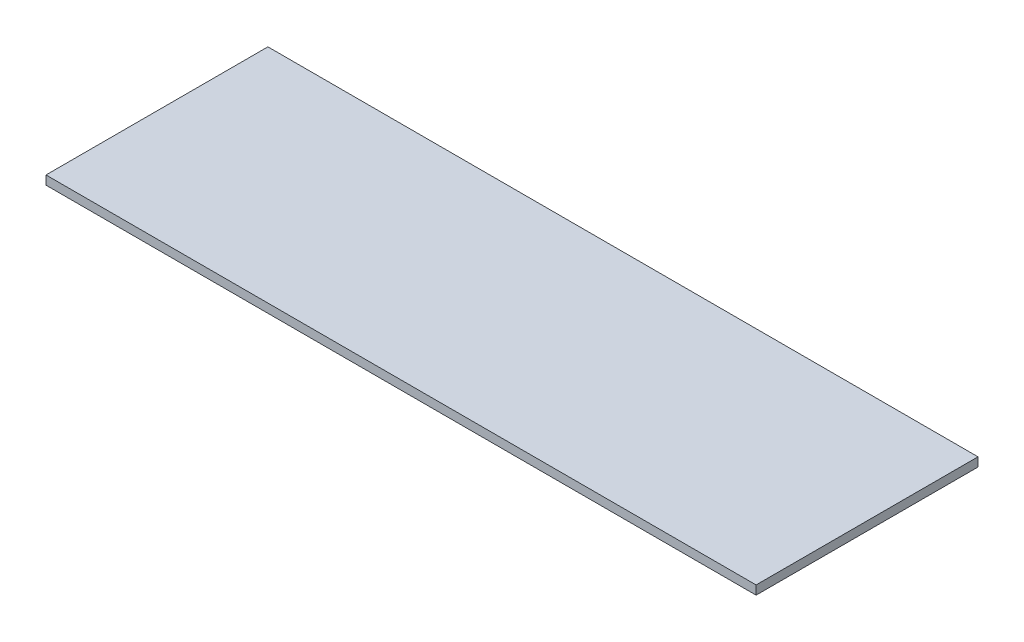
ISO-10303-21;
HEADER;
FILE_DESCRIPTION(('STEP AP214'),'2;1');
FILE_NAME('part.step','',(''),(''),'','','');
FILE_SCHEMA(('AUTOMOTIVE_DESIGN { 1 0 10303 214 1 1 1 1 }'));
ENDSEC;
DATA;
#1=APPLICATION_CONTEXT('core data for automotive mechanical design processes');
#2=APPLICATION_PROTOCOL_DEFINITION('international standard','automotive_design',2000,#1);
#3=PRODUCT_CONTEXT('',#1,'mechanical');
#4=PRODUCT('Part','Part','',(#3));
#5=PRODUCT_RELATED_PRODUCT_CATEGORY('part','',(#4));
#6=PRODUCT_DEFINITION_FORMATION('','',#4);
#7=PRODUCT_DEFINITION_CONTEXT('part definition',#1,'design');
#8=PRODUCT_DEFINITION('design','',#6,#7);
#9=PRODUCT_DEFINITION_SHAPE('','',#8);
#10=(LENGTH_UNIT() NAMED_UNIT(*) SI_UNIT(.MILLI.,.METRE.));
#11=(NAMED_UNIT(*) PLANE_ANGLE_UNIT() SI_UNIT($,.RADIAN.));
#12=(NAMED_UNIT(*) SI_UNIT($,.STERADIAN.) SOLID_ANGLE_UNIT());
#13=UNCERTAINTY_MEASURE_WITH_UNIT(LENGTH_MEASURE(1.E-05),#10,'distance_accuracy_value','');
#14=(GEOMETRIC_REPRESENTATION_CONTEXT(3) GLOBAL_UNCERTAINTY_ASSIGNED_CONTEXT((#13)) GLOBAL_UNIT_ASSIGNED_CONTEXT((#10,
#11,#12)) REPRESENTATION_CONTEXT('',''));
#15=CARTESIAN_POINT('',(0.,0.,0.));
#16=DIRECTION('',(0.,0.,1.));
#17=DIRECTION('',(1.,0.,0.));
#18=AXIS2_PLACEMENT_3D('',#15,#16,#17);
#19=CARTESIAN_POINT('',(0.,2.,0.));
#20=DIRECTION('',(1.,0.,0.));
#21=DIRECTION('',(0.,0.,-1.));
#22=AXIS2_PLACEMENT_3D('',#19,#20,#21);
#23=PLANE('',#22);
#24=DIRECTION('',(0.,0.,1.));
#25=VECTOR('',#24,1.);
#26=CARTESIAN_POINT('',(0.,0.,0.));
#27=LINE('',#26,#25);
#28=CARTESIAN_POINT('',(0.,0.,-50.));
#29=VERTEX_POINT('',#28);
#30=CARTESIAN_POINT('',(0.,0.,0.));
#31=VERTEX_POINT('',#30);
#32=EDGE_CURVE('E96',#29,#31,#27,.T.);
#33=ORIENTED_EDGE('',*,*,#32,.T.);
#34=DIRECTION('',(0.,-1.,0.));
#35=VECTOR('',#34,1.);
#36=CARTESIAN_POINT('',(0.,2.,0.));
#37=LINE('',#36,#35);
#38=CARTESIAN_POINT('',(0.,2.,0.));
#39=VERTEX_POINT('',#38);
#40=EDGE_CURVE('E11',#39,#31,#37,.T.);
#41=ORIENTED_EDGE('',*,*,#40,.F.);
#42=DIRECTION('',(0.,0.,1.));
#43=VECTOR('',#42,1.);
#44=CARTESIAN_POINT('',(0.,2.,0.));
#45=LINE('',#44,#43);
#46=CARTESIAN_POINT('',(0.,2.,-50.));
#47=VERTEX_POINT('',#46);
#48=EDGE_CURVE('E84',#47,#39,#45,.T.);
#49=ORIENTED_EDGE('',*,*,#48,.F.);
#50=DIRECTION('',(0.,-1.,0.));
#51=VECTOR('',#50,1.);
#52=CARTESIAN_POINT('',(0.,2.,-50.));
#53=LINE('',#52,#51);
#54=EDGE_CURVE('E92',#47,#29,#53,.T.);
#55=ORIENTED_EDGE('',*,*,#54,.T.);
#56=EDGE_LOOP('',(#33,#41,#49,#55));
#57=FACE_BOUND('',#56,.T.);
#58=ADVANCED_FACE('F33',(#57),#23,.F.);
#59=CARTESIAN_POINT('',(0.,2.,0.));
#60=DIRECTION('',(0.,0.,-1.));
#61=DIRECTION('',(-1.,0.,0.));
#62=AXIS2_PLACEMENT_3D('',#59,#60,#61);
#63=PLANE('',#62);
#64=DIRECTION('',(1.,0.,0.));
#65=VECTOR('',#64,1.);
#66=CARTESIAN_POINT('',(0.,0.,0.));
#67=LINE('',#66,#65);
#68=CARTESIAN_POINT('',(160.,0.,0.));
#69=VERTEX_POINT('',#68);
#70=EDGE_CURVE('E88',#31,#69,#67,.T.);
#71=ORIENTED_EDGE('',*,*,#70,.T.);
#72=DIRECTION('',(0.,-1.,0.));
#73=VECTOR('',#72,1.);
#74=CARTESIAN_POINT('',(160.,2.,0.));
#75=LINE('',#74,#73);
#76=CARTESIAN_POINT('',(160.,2.,0.));
#77=VERTEX_POINT('',#76);
#78=EDGE_CURVE('E41',#77,#69,#75,.T.);
#79=ORIENTED_EDGE('',*,*,#78,.F.);
#80=DIRECTION('',(1.,0.,0.));
#81=VECTOR('',#80,1.);
#82=CARTESIAN_POINT('',(0.,2.,0.));
#83=LINE('',#82,#81);
#84=EDGE_CURVE('E79',#39,#77,#83,.T.);
#85=ORIENTED_EDGE('',*,*,#84,.F.);
#86=ORIENTED_EDGE('',*,*,#40,.T.);
#87=EDGE_LOOP('',(#71,#79,#85,#86));
#88=FACE_BOUND('',#87,.T.);
#89=ADVANCED_FACE('F87',(#88),#63,.F.);
#90=CARTESIAN_POINT('',(160.,2.,0.));
#91=DIRECTION('',(-1.,0.,0.));
#92=DIRECTION('',(0.,0.,1.));
#93=AXIS2_PLACEMENT_3D('',#90,#91,#92);
#94=PLANE('',#93);
#95=DIRECTION('',(0.,0.,-1.));
#96=VECTOR('',#95,1.);
#97=CARTESIAN_POINT('',(160.,0.,0.));
#98=LINE('',#97,#96);
#99=CARTESIAN_POINT('',(160.,0.,-50.));
#100=VERTEX_POINT('',#99);
#101=EDGE_CURVE('E66',#69,#100,#98,.T.);
#102=ORIENTED_EDGE('',*,*,#101,.T.);
#103=DIRECTION('',(0.,-1.,0.));
#104=VECTOR('',#103,1.);
#105=CARTESIAN_POINT('',(160.,2.,-50.));
#106=LINE('',#105,#104);
#107=CARTESIAN_POINT('',(160.,2.,-50.));
#108=VERTEX_POINT('',#107);
#109=EDGE_CURVE('E89',#108,#100,#106,.T.);
#110=ORIENTED_EDGE('',*,*,#109,.F.);
#111=DIRECTION('',(0.,0.,-1.));
#112=VECTOR('',#111,1.);
#113=CARTESIAN_POINT('',(160.,2.,0.));
#114=LINE('',#113,#112);
#115=EDGE_CURVE('E82',#77,#108,#114,.T.);
#116=ORIENTED_EDGE('',*,*,#115,.F.);
#117=ORIENTED_EDGE('',*,*,#78,.T.);
#118=EDGE_LOOP('',(#102,#110,#116,#117));
#119=FACE_BOUND('',#118,.T.);
#120=ADVANCED_FACE('F90',(#119),#94,.F.);
#121=CARTESIAN_POINT('',(0.,2.,-50.));
#122=DIRECTION('',(0.,0.,1.));
#123=DIRECTION('',(1.,0.,0.));
#124=AXIS2_PLACEMENT_3D('',#121,#122,#123);
#125=PLANE('',#124);
#126=DIRECTION('',(-1.,0.,0.));
#127=VECTOR('',#126,1.);
#128=CARTESIAN_POINT('',(0.,0.,-50.));
#129=LINE('',#128,#127);
#130=EDGE_CURVE('E72',#100,#29,#129,.T.);
#131=ORIENTED_EDGE('',*,*,#130,.T.);
#132=ORIENTED_EDGE('',*,*,#54,.F.);
#133=DIRECTION('',(-1.,0.,0.));
#134=VECTOR('',#133,1.);
#135=CARTESIAN_POINT('',(0.,2.,-50.));
#136=LINE('',#135,#134);
#137=EDGE_CURVE('E49',#108,#47,#136,.T.);
#138=ORIENTED_EDGE('',*,*,#137,.F.);
#139=ORIENTED_EDGE('',*,*,#109,.T.);
#140=EDGE_LOOP('',(#131,#132,#138,#139));
#141=FACE_BOUND('',#140,.T.);
#142=ADVANCED_FACE('F103',(#141),#125,.F.);
#143=CARTESIAN_POINT('',(0.,2.,0.));
#144=DIRECTION('',(0.,-1.,0.));
#145=DIRECTION('',(0.,0.,-1.));
#146=AXIS2_PLACEMENT_3D('',#143,#144,#145);
#147=PLANE('',#146);
#148=ORIENTED_EDGE('',*,*,#48,.T.);
#149=ORIENTED_EDGE('',*,*,#84,.T.);
#150=ORIENTED_EDGE('',*,*,#115,.T.);
#151=ORIENTED_EDGE('',*,*,#137,.T.);
#152=EDGE_LOOP('',(#148,#149,#150,#151));
#153=FACE_BOUND('',#152,.T.);
#154=ADVANCED_FACE('F80',(#153),#147,.F.);
#155=CARTESIAN_POINT('',(0.,0.,0.));
#156=DIRECTION('',(0.,-1.,0.));
#157=DIRECTION('',(0.,0.,-1.));
#158=AXIS2_PLACEMENT_3D('',#155,#156,#157);
#159=PLANE('',#158);
#160=ORIENTED_EDGE('',*,*,#32,.F.);
#161=ORIENTED_EDGE('',*,*,#130,.F.);
#162=ORIENTED_EDGE('',*,*,#101,.F.);
#163=ORIENTED_EDGE('',*,*,#70,.F.);
#164=EDGE_LOOP('',(#160,#161,#162,#163));
#165=FACE_BOUND('',#164,.T.);
#166=ADVANCED_FACE('F106',(#165),#159,.T.);
#167=CLOSED_SHELL('',(#58,#89,#120,#142,#154,#166));
#168=MANIFOLD_SOLID_BREP('B2',#167);
#169=ADVANCED_BREP_SHAPE_REPRESENTATION('',(#18,#168),#14);
#170=SHAPE_DEFINITION_REPRESENTATION(#9,#169);
ENDSEC;
END-ISO-10303-21;
